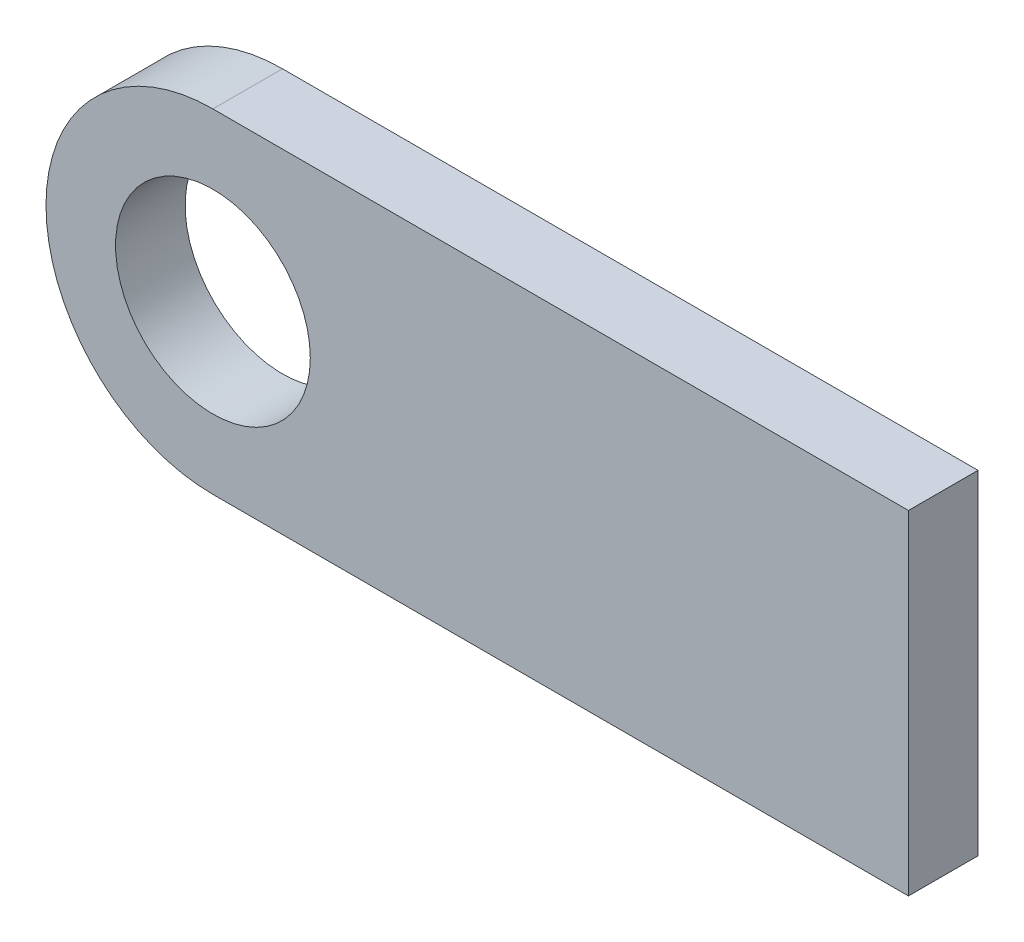
ISO-10303-21;
HEADER;
FILE_DESCRIPTION(('STEP AP214'),'2;1');
FILE_NAME('part.step','',(''),(''),'','','');
FILE_SCHEMA(('AUTOMOTIVE_DESIGN { 1 0 10303 214 1 1 1 1 }'));
ENDSEC;
DATA;
#1=APPLICATION_CONTEXT('core data for automotive mechanical design processes');
#2=APPLICATION_PROTOCOL_DEFINITION('international standard','automotive_design',2000,#1);
#3=PRODUCT_CONTEXT('',#1,'mechanical');
#4=PRODUCT('Part','Part','',(#3));
#5=PRODUCT_RELATED_PRODUCT_CATEGORY('part','',(#4));
#6=PRODUCT_DEFINITION_FORMATION('','',#4);
#7=PRODUCT_DEFINITION_CONTEXT('part definition',#1,'design');
#8=PRODUCT_DEFINITION('design','',#6,#7);
#9=PRODUCT_DEFINITION_SHAPE('','',#8);
#10=(LENGTH_UNIT() NAMED_UNIT(*) SI_UNIT(.MILLI.,.METRE.));
#11=(NAMED_UNIT(*) PLANE_ANGLE_UNIT() SI_UNIT($,.RADIAN.));
#12=(NAMED_UNIT(*) SI_UNIT($,.STERADIAN.) SOLID_ANGLE_UNIT());
#13=UNCERTAINTY_MEASURE_WITH_UNIT(LENGTH_MEASURE(1.E-05),#10,'distance_accuracy_value','');
#14=(GEOMETRIC_REPRESENTATION_CONTEXT(3) GLOBAL_UNCERTAINTY_ASSIGNED_CONTEXT((#13)) GLOBAL_UNIT_ASSIGNED_CONTEXT((#10,
#11,#12)) REPRESENTATION_CONTEXT('',''));
#15=CARTESIAN_POINT('',(0.,0.,0.));
#16=DIRECTION('',(0.,0.,1.));
#17=DIRECTION('',(1.,0.,0.));
#18=AXIS2_PLACEMENT_3D('',#15,#16,#17);
#19=CARTESIAN_POINT('',(0.,12.,5.));
#20=DIRECTION('',(0.,0.,1.));
#21=DIRECTION('',(1.,0.,0.));
#22=AXIS2_PLACEMENT_3D('',#19,#20,#21);
#23=PLANE('',#22);
#24=CARTESIAN_POINT('',(0.,12.,5.));
#25=DIRECTION('',(0.,0.,1.));
#26=DIRECTION('',(1.,0.,0.));
#27=AXIS2_PLACEMENT_3D('',#24,#25,#26);
#28=CIRCLE('',#27,12.);
#29=CARTESIAN_POINT('',(0.,24.,5.));
#30=VERTEX_POINT('',#29);
#31=CARTESIAN_POINT('',(0.,0.,5.));
#32=VERTEX_POINT('',#31);
#33=EDGE_CURVE('E92',#30,#32,#28,.T.);
#34=ORIENTED_EDGE('',*,*,#33,.T.);
#35=DIRECTION('',(1.,0.,0.));
#36=VECTOR('',#35,1.);
#37=CARTESIAN_POINT('',(0.,0.,5.));
#38=LINE('',#37,#36);
#39=CARTESIAN_POINT('',(50.,0.,5.));
#40=VERTEX_POINT('',#39);
#41=EDGE_CURVE('E87',#32,#40,#38,.T.);
#42=ORIENTED_EDGE('',*,*,#41,.T.);
#43=DIRECTION('',(0.,1.,0.));
#44=VECTOR('',#43,1.);
#45=CARTESIAN_POINT('',(50.,0.,5.));
#46=LINE('',#45,#44);
#47=CARTESIAN_POINT('',(50.,24.,5.));
#48=VERTEX_POINT('',#47);
#49=EDGE_CURVE('E90',#40,#48,#46,.T.);
#50=ORIENTED_EDGE('',*,*,#49,.T.);
#51=DIRECTION('',(-1.,0.,0.));
#52=VECTOR('',#51,1.);
#53=CARTESIAN_POINT('',(0.,24.,5.));
#54=LINE('',#53,#52);
#55=EDGE_CURVE('E57',#48,#30,#54,.T.);
#56=ORIENTED_EDGE('',*,*,#55,.T.);
#57=EDGE_LOOP('',(#34,#42,#50,#56));
#58=FACE_BOUND('',#57,.T.);
#59=CARTESIAN_POINT('',(0.,12.,5.));
#60=DIRECTION('',(0.,0.,1.));
#61=DIRECTION('',(1.,0.,0.));
#62=AXIS2_PLACEMENT_3D('',#59,#60,#61);
#63=CIRCLE('',#62,7.);
#64=CARTESIAN_POINT('',(7.,12.,5.));
#65=VERTEX_POINT('',#64);
#66=EDGE_CURVE('E112',#65,#65,#63,.T.);
#67=ORIENTED_EDGE('',*,*,#66,.F.);
#68=EDGE_LOOP('',(#67));
#69=FACE_BOUND('',#68,.T.);
#70=ADVANCED_FACE('F39',(#58,#69),#23,.T.);
#71=CARTESIAN_POINT('',(0.,12.,0.));
#72=DIRECTION('',(0.,0.,1.));
#73=DIRECTION('',(1.,0.,0.));
#74=AXIS2_PLACEMENT_3D('',#71,#72,#73);
#75=PLANE('',#74);
#76=CARTESIAN_POINT('',(0.,12.,0.));
#77=DIRECTION('',(0.,0.,1.));
#78=DIRECTION('',(1.,0.,0.));
#79=AXIS2_PLACEMENT_3D('',#76,#77,#78);
#80=CIRCLE('',#79,12.);
#81=CARTESIAN_POINT('',(0.,24.,0.));
#82=VERTEX_POINT('',#81);
#83=CARTESIAN_POINT('',(0.,0.,0.));
#84=VERTEX_POINT('',#83);
#85=EDGE_CURVE('E108',#82,#84,#80,.T.);
#86=ORIENTED_EDGE('',*,*,#85,.F.);
#87=DIRECTION('',(-1.,0.,0.));
#88=VECTOR('',#87,1.);
#89=CARTESIAN_POINT('',(0.,24.,0.));
#90=LINE('',#89,#88);
#91=CARTESIAN_POINT('',(50.,24.,0.));
#92=VERTEX_POINT('',#91);
#93=EDGE_CURVE('E80',#92,#82,#90,.T.);
#94=ORIENTED_EDGE('',*,*,#93,.F.);
#95=DIRECTION('',(0.,1.,0.));
#96=VECTOR('',#95,1.);
#97=CARTESIAN_POINT('',(50.,0.,0.));
#98=LINE('',#97,#96);
#99=CARTESIAN_POINT('',(50.,0.,0.));
#100=VERTEX_POINT('',#99);
#101=EDGE_CURVE('E74',#100,#92,#98,.T.);
#102=ORIENTED_EDGE('',*,*,#101,.F.);
#103=DIRECTION('',(1.,0.,0.));
#104=VECTOR('',#103,1.);
#105=CARTESIAN_POINT('',(0.,0.,0.));
#106=LINE('',#105,#104);
#107=EDGE_CURVE('E97',#84,#100,#106,.T.);
#108=ORIENTED_EDGE('',*,*,#107,.F.);
#109=EDGE_LOOP('',(#86,#94,#102,#108));
#110=FACE_BOUND('',#109,.T.);
#111=CARTESIAN_POINT('',(0.,12.,0.));
#112=DIRECTION('',(0.,0.,1.));
#113=DIRECTION('',(1.,0.,0.));
#114=AXIS2_PLACEMENT_3D('',#111,#112,#113);
#115=CIRCLE('',#114,7.);
#116=CARTESIAN_POINT('',(7.,12.,0.));
#117=VERTEX_POINT('',#116);
#118=EDGE_CURVE('E130',#117,#117,#115,.T.);
#119=ORIENTED_EDGE('',*,*,#118,.T.);
#120=EDGE_LOOP('',(#119));
#121=FACE_BOUND('',#120,.T.);
#122=ADVANCED_FACE('F125',(#110,#121),#75,.F.);
#123=CARTESIAN_POINT('',(0.,12.,5.));
#124=DIRECTION('',(0.,0.,-1.));
#125=DIRECTION('',(-1.,0.,0.));
#126=AXIS2_PLACEMENT_3D('',#123,#124,#125);
#127=CYLINDRICAL_SURFACE('',#126,12.);
#128=ORIENTED_EDGE('',*,*,#85,.T.);
#129=DIRECTION('',(0.,0.,-1.));
#130=VECTOR('',#129,1.);
#131=CARTESIAN_POINT('',(0.,0.,5.));
#132=LINE('',#131,#130);
#133=EDGE_CURVE('E11',#32,#84,#132,.T.);
#134=ORIENTED_EDGE('',*,*,#133,.F.);
#135=ORIENTED_EDGE('',*,*,#33,.F.);
#136=DIRECTION('',(0.,0.,-1.));
#137=VECTOR('',#136,1.);
#138=CARTESIAN_POINT('',(0.,24.,5.));
#139=LINE('',#138,#137);
#140=EDGE_CURVE('E104',#30,#82,#139,.T.);
#141=ORIENTED_EDGE('',*,*,#140,.T.);
#142=EDGE_LOOP('',(#128,#134,#135,#141));
#143=FACE_BOUND('',#142,.T.);
#144=ADVANCED_FACE('F41',(#143),#127,.T.);
#145=CARTESIAN_POINT('',(0.,0.,5.));
#146=DIRECTION('',(0.,1.,0.));
#147=DIRECTION('',(0.,0.,1.));
#148=AXIS2_PLACEMENT_3D('',#145,#146,#147);
#149=PLANE('',#148);
#150=ORIENTED_EDGE('',*,*,#107,.T.);
#151=DIRECTION('',(0.,0.,-1.));
#152=VECTOR('',#151,1.);
#153=CARTESIAN_POINT('',(50.,0.,5.));
#154=LINE('',#153,#152);
#155=EDGE_CURVE('E49',#40,#100,#154,.T.);
#156=ORIENTED_EDGE('',*,*,#155,.F.);
#157=ORIENTED_EDGE('',*,*,#41,.F.);
#158=ORIENTED_EDGE('',*,*,#133,.T.);
#159=EDGE_LOOP('',(#150,#156,#157,#158));
#160=FACE_BOUND('',#159,.T.);
#161=ADVANCED_FACE('F96',(#160),#149,.F.);
#162=CARTESIAN_POINT('',(50.,0.,5.));
#163=DIRECTION('',(-1.,0.,0.));
#164=DIRECTION('',(0.,0.,1.));
#165=AXIS2_PLACEMENT_3D('',#162,#163,#164);
#166=PLANE('',#165);
#167=ORIENTED_EDGE('',*,*,#101,.T.);
#168=DIRECTION('',(0.,0.,-1.));
#169=VECTOR('',#168,1.);
#170=CARTESIAN_POINT('',(50.,24.,5.));
#171=LINE('',#170,#169);
#172=EDGE_CURVE('E99',#48,#92,#171,.T.);
#173=ORIENTED_EDGE('',*,*,#172,.F.);
#174=ORIENTED_EDGE('',*,*,#49,.F.);
#175=ORIENTED_EDGE('',*,*,#155,.T.);
#176=EDGE_LOOP('',(#167,#173,#174,#175));
#177=FACE_BOUND('',#176,.T.);
#178=ADVANCED_FACE('F100',(#177),#166,.F.);
#179=CARTESIAN_POINT('',(0.,24.,5.));
#180=DIRECTION('',(0.,-1.,0.));
#181=DIRECTION('',(0.,0.,-1.));
#182=AXIS2_PLACEMENT_3D('',#179,#180,#181);
#183=PLANE('',#182);
#184=ORIENTED_EDGE('',*,*,#93,.T.);
#185=ORIENTED_EDGE('',*,*,#140,.F.);
#186=ORIENTED_EDGE('',*,*,#55,.F.);
#187=ORIENTED_EDGE('',*,*,#172,.T.);
#188=EDGE_LOOP('',(#184,#185,#186,#187));
#189=FACE_BOUND('',#188,.T.);
#190=ADVANCED_FACE('F122',(#189),#183,.F.);
#191=CARTESIAN_POINT('',(0.,12.,5.));
#192=DIRECTION('',(0.,0.,-1.));
#193=DIRECTION('',(-1.,0.,0.));
#194=AXIS2_PLACEMENT_3D('',#191,#192,#193);
#195=CYLINDRICAL_SURFACE('',#194,7.);
#196=ORIENTED_EDGE('',*,*,#66,.T.);
#197=EDGE_LOOP('',(#196));
#198=FACE_BOUND('',#197,.T.);
#199=ORIENTED_EDGE('',*,*,#118,.F.);
#200=EDGE_LOOP('',(#199));
#201=FACE_BOUND('',#200,.T.);
#202=ADVANCED_FACE('F138',(#198,#201),#195,.F.);
#203=CLOSED_SHELL('',(#70,#122,#144,#161,#178,#190,#202));
#204=MANIFOLD_SOLID_BREP('B2',#203);
#205=ADVANCED_BREP_SHAPE_REPRESENTATION('',(#18,#204),#14);
#206=SHAPE_DEFINITION_REPRESENTATION(#9,#205);
ENDSEC;
END-ISO-10303-21;
